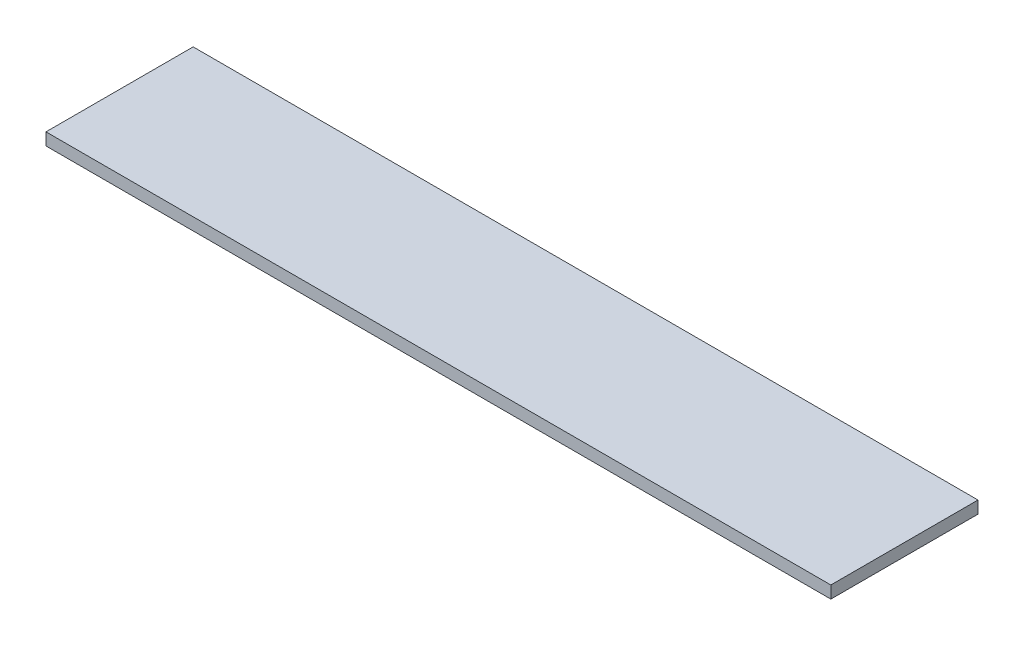
ISO-10303-21;
HEADER;
FILE_DESCRIPTION(('STEP AP214'),'2;1');
FILE_NAME('part.step','',(''),(''),'','','');
FILE_SCHEMA(('AUTOMOTIVE_DESIGN { 1 0 10303 214 1 1 1 1 }'));
ENDSEC;
DATA;
#1=APPLICATION_CONTEXT('core data for automotive mechanical design processes');
#2=APPLICATION_PROTOCOL_DEFINITION('international standard','automotive_design',2000,#1);
#3=PRODUCT_CONTEXT('',#1,'mechanical');
#4=PRODUCT('Part','Part','',(#3));
#5=PRODUCT_RELATED_PRODUCT_CATEGORY('part','',(#4));
#6=PRODUCT_DEFINITION_FORMATION('','',#4);
#7=PRODUCT_DEFINITION_CONTEXT('part definition',#1,'design');
#8=PRODUCT_DEFINITION('design','',#6,#7);
#9=PRODUCT_DEFINITION_SHAPE('','',#8);
#10=(LENGTH_UNIT() NAMED_UNIT(*) SI_UNIT(.MILLI.,.METRE.));
#11=(NAMED_UNIT(*) PLANE_ANGLE_UNIT() SI_UNIT($,.RADIAN.));
#12=(NAMED_UNIT(*) SI_UNIT($,.STERADIAN.) SOLID_ANGLE_UNIT());
#13=UNCERTAINTY_MEASURE_WITH_UNIT(LENGTH_MEASURE(1.E-05),#10,'distance_accuracy_value','');
#14=(GEOMETRIC_REPRESENTATION_CONTEXT(3) GLOBAL_UNCERTAINTY_ASSIGNED_CONTEXT((#13)) GLOBAL_UNIT_ASSIGNED_CONTEXT((#10,
#11,#12)) REPRESENTATION_CONTEXT('',''));
#15=CARTESIAN_POINT('',(0.,0.,0.));
#16=DIRECTION('',(0.,0.,1.));
#17=DIRECTION('',(1.,0.,0.));
#18=AXIS2_PLACEMENT_3D('',#15,#16,#17);
#19=CARTESIAN_POINT('',(0.,6.35,0.));
#20=DIRECTION('',(1.,0.,0.));
#21=DIRECTION('',(0.,0.,1.));
#22=AXIS2_PLACEMENT_3D('',#19,#20,#21);
#23=PLANE('',#22);
#24=DIRECTION('',(0.,0.,-1.));
#25=VECTOR('',#24,1.);
#26=CARTESIAN_POINT('',(0.,0.,0.));
#27=LINE('',#26,#25);
#28=CARTESIAN_POINT('',(0.,0.,76.2));
#29=VERTEX_POINT('',#28);
#30=CARTESIAN_POINT('',(0.,0.,0.));
#31=VERTEX_POINT('',#30);
#32=EDGE_CURVE('E100',#29,#31,#27,.T.);
#33=ORIENTED_EDGE('',*,*,#32,.F.);
#34=DIRECTION('',(0.,-1.,0.));
#35=VECTOR('',#34,1.);
#36=CARTESIAN_POINT('',(0.,6.35,76.2));
#37=LINE('',#36,#35);
#38=CARTESIAN_POINT('',(0.,6.35,76.2));
#39=VERTEX_POINT('',#38);
#40=EDGE_CURVE('E99',#39,#29,#37,.T.);
#41=ORIENTED_EDGE('',*,*,#40,.F.);
#42=DIRECTION('',(0.,0.,-1.));
#43=VECTOR('',#42,1.);
#44=CARTESIAN_POINT('',(0.,6.35,0.));
#45=LINE('',#44,#43);
#46=CARTESIAN_POINT('',(0.,6.35,0.));
#47=VERTEX_POINT('',#46);
#48=EDGE_CURVE('E94',#39,#47,#45,.T.);
#49=ORIENTED_EDGE('',*,*,#48,.T.);
#50=DIRECTION('',(0.,-1.,0.));
#51=VECTOR('',#50,1.);
#52=CARTESIAN_POINT('',(0.,6.35,0.));
#53=LINE('',#52,#51);
#54=EDGE_CURVE('E11',#47,#31,#53,.T.);
#55=ORIENTED_EDGE('',*,*,#54,.T.);
#56=EDGE_LOOP('',(#33,#41,#49,#55));
#57=FACE_BOUND('',#56,.T.);
#58=ADVANCED_FACE('F37',(#57),#23,.F.);
#59=CARTESIAN_POINT('',(0.,6.35,0.));
#60=DIRECTION('',(0.,0.,1.));
#61=DIRECTION('',(-1.,0.,0.));
#62=AXIS2_PLACEMENT_3D('',#59,#60,#61);
#63=PLANE('',#62);
#64=DIRECTION('',(1.,0.,0.));
#65=VECTOR('',#64,1.);
#66=CARTESIAN_POINT('',(0.,0.,0.));
#67=LINE('',#66,#65);
#68=CARTESIAN_POINT('',(406.4,0.,0.));
#69=VERTEX_POINT('',#68);
#70=EDGE_CURVE('E102',#31,#69,#67,.T.);
#71=ORIENTED_EDGE('',*,*,#70,.F.);
#72=ORIENTED_EDGE('',*,*,#54,.F.);
#73=DIRECTION('',(1.,0.,0.));
#74=VECTOR('',#73,1.);
#75=CARTESIAN_POINT('',(0.,6.35,0.));
#76=LINE('',#75,#74);
#77=CARTESIAN_POINT('',(406.4,6.35,0.));
#78=VERTEX_POINT('',#77);
#79=EDGE_CURVE('E78',#47,#78,#76,.T.);
#80=ORIENTED_EDGE('',*,*,#79,.T.);
#81=DIRECTION('',(0.,-1.,0.));
#82=VECTOR('',#81,1.);
#83=CARTESIAN_POINT('',(406.4,6.35,0.));
#84=LINE('',#83,#82);
#85=EDGE_CURVE('E45',#78,#69,#84,.T.);
#86=ORIENTED_EDGE('',*,*,#85,.T.);
#87=EDGE_LOOP('',(#71,#72,#80,#86));
#88=FACE_BOUND('',#87,.T.);
#89=ADVANCED_FACE('F92',(#88),#63,.F.);
#90=CARTESIAN_POINT('',(406.4,6.35,0.));
#91=DIRECTION('',(-1.,0.,0.));
#92=DIRECTION('',(0.,0.,-1.));
#93=AXIS2_PLACEMENT_3D('',#90,#91,#92);
#94=PLANE('',#93);
#95=DIRECTION('',(0.,0.,1.));
#96=VECTOR('',#95,1.);
#97=CARTESIAN_POINT('',(406.4,0.,0.));
#98=LINE('',#97,#96);
#99=CARTESIAN_POINT('',(406.4,0.,76.2));
#100=VERTEX_POINT('',#99);
#101=EDGE_CURVE('E88',#69,#100,#98,.T.);
#102=ORIENTED_EDGE('',*,*,#101,.F.);
#103=ORIENTED_EDGE('',*,*,#85,.F.);
#104=DIRECTION('',(0.,0.,1.));
#105=VECTOR('',#104,1.);
#106=CARTESIAN_POINT('',(406.4,6.35,0.));
#107=LINE('',#106,#105);
#108=CARTESIAN_POINT('',(406.4,6.35,76.2));
#109=VERTEX_POINT('',#108);
#110=EDGE_CURVE('E81',#78,#109,#107,.T.);
#111=ORIENTED_EDGE('',*,*,#110,.T.);
#112=DIRECTION('',(0.,-1.,0.));
#113=VECTOR('',#112,1.);
#114=CARTESIAN_POINT('',(406.4,6.35,76.2));
#115=LINE('',#114,#113);
#116=EDGE_CURVE('E91',#109,#100,#115,.T.);
#117=ORIENTED_EDGE('',*,*,#116,.T.);
#118=EDGE_LOOP('',(#102,#103,#111,#117));
#119=FACE_BOUND('',#118,.T.);
#120=ADVANCED_FACE('F87',(#119),#94,.F.);
#121=CARTESIAN_POINT('',(0.,6.35,76.2));
#122=DIRECTION('',(0.,0.,-1.));
#123=DIRECTION('',(1.,0.,0.));
#124=AXIS2_PLACEMENT_3D('',#121,#122,#123);
#125=PLANE('',#124);
#126=DIRECTION('',(-1.,0.,0.));
#127=VECTOR('',#126,1.);
#128=CARTESIAN_POINT('',(0.,0.,76.2));
#129=LINE('',#128,#127);
#130=EDGE_CURVE('E67',#100,#29,#129,.T.);
#131=ORIENTED_EDGE('',*,*,#130,.F.);
#132=ORIENTED_EDGE('',*,*,#116,.F.);
#133=DIRECTION('',(-1.,0.,0.));
#134=VECTOR('',#133,1.);
#135=CARTESIAN_POINT('',(0.,6.35,76.2));
#136=LINE('',#135,#134);
#137=EDGE_CURVE('E53',#109,#39,#136,.T.);
#138=ORIENTED_EDGE('',*,*,#137,.T.);
#139=ORIENTED_EDGE('',*,*,#40,.T.);
#140=EDGE_LOOP('',(#131,#132,#138,#139));
#141=FACE_BOUND('',#140,.T.);
#142=ADVANCED_FACE('F111',(#141),#125,.F.);
#143=CARTESIAN_POINT('',(0.,6.35,0.));
#144=DIRECTION('',(0.,-1.,0.));
#145=DIRECTION('',(0.,0.,1.));
#146=AXIS2_PLACEMENT_3D('',#143,#144,#145);
#147=PLANE('',#146);
#148=ORIENTED_EDGE('',*,*,#48,.F.);
#149=ORIENTED_EDGE('',*,*,#137,.F.);
#150=ORIENTED_EDGE('',*,*,#110,.F.);
#151=ORIENTED_EDGE('',*,*,#79,.F.);
#152=EDGE_LOOP('',(#148,#149,#150,#151));
#153=FACE_BOUND('',#152,.T.);
#154=ADVANCED_FACE('F83',(#153),#147,.F.);
#155=CARTESIAN_POINT('',(0.,0.,0.));
#156=DIRECTION('',(0.,-1.,0.));
#157=DIRECTION('',(0.,0.,1.));
#158=AXIS2_PLACEMENT_3D('',#155,#156,#157);
#159=PLANE('',#158);
#160=ORIENTED_EDGE('',*,*,#32,.T.);
#161=ORIENTED_EDGE('',*,*,#70,.T.);
#162=ORIENTED_EDGE('',*,*,#101,.T.);
#163=ORIENTED_EDGE('',*,*,#130,.T.);
#164=EDGE_LOOP('',(#160,#161,#162,#163));
#165=FACE_BOUND('',#164,.T.);
#166=ADVANCED_FACE('F107',(#165),#159,.T.);
#167=CLOSED_SHELL('',(#58,#89,#120,#142,#154,#166));
#168=MANIFOLD_SOLID_BREP('B2',#167);
#169=ADVANCED_BREP_SHAPE_REPRESENTATION('',(#18,#168),#14);
#170=SHAPE_DEFINITION_REPRESENTATION(#9,#169);
ENDSEC;
END-ISO-10303-21;
